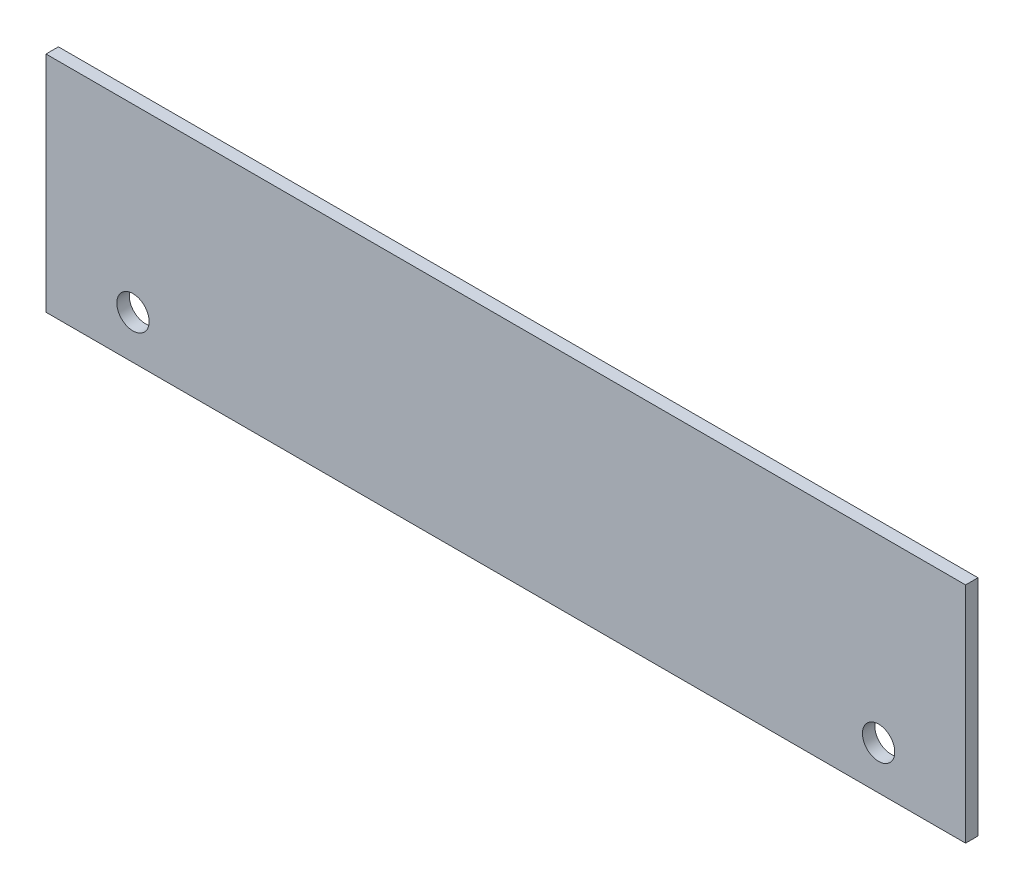
ISO-10303-21;
HEADER;
FILE_DESCRIPTION(('STEP AP214'),'2;1');
FILE_NAME('part.step','',(''),(''),'','','');
FILE_SCHEMA(('AUTOMOTIVE_DESIGN { 1 0 10303 214 1 1 1 1 }'));
ENDSEC;
DATA;
#1=APPLICATION_CONTEXT('core data for automotive mechanical design processes');
#2=APPLICATION_PROTOCOL_DEFINITION('international standard','automotive_design',2000,#1);
#3=PRODUCT_CONTEXT('',#1,'mechanical');
#4=PRODUCT('Part','Part','',(#3));
#5=PRODUCT_RELATED_PRODUCT_CATEGORY('part','',(#4));
#6=PRODUCT_DEFINITION_FORMATION('','',#4);
#7=PRODUCT_DEFINITION_CONTEXT('part definition',#1,'design');
#8=PRODUCT_DEFINITION('design','',#6,#7);
#9=PRODUCT_DEFINITION_SHAPE('','',#8);
#10=(LENGTH_UNIT() NAMED_UNIT(*) SI_UNIT(.MILLI.,.METRE.));
#11=(NAMED_UNIT(*) PLANE_ANGLE_UNIT() SI_UNIT($,.RADIAN.));
#12=(NAMED_UNIT(*) SI_UNIT($,.STERADIAN.) SOLID_ANGLE_UNIT());
#13=UNCERTAINTY_MEASURE_WITH_UNIT(LENGTH_MEASURE(1.E-05),#10,'distance_accuracy_value','');
#14=(GEOMETRIC_REPRESENTATION_CONTEXT(3) GLOBAL_UNCERTAINTY_ASSIGNED_CONTEXT((#13)) GLOBAL_UNIT_ASSIGNED_CONTEXT((#10,
#11,#12)) REPRESENTATION_CONTEXT('',''));
#15=CARTESIAN_POINT('',(0.,0.,0.));
#16=DIRECTION('',(0.,0.,1.));
#17=DIRECTION('',(1.,0.,0.));
#18=AXIS2_PLACEMENT_3D('',#15,#16,#17);
#19=CARTESIAN_POINT('',(0.,0.,5.));
#20=DIRECTION('',(0.,0.,1.));
#21=DIRECTION('',(1.,0.,0.));
#22=AXIS2_PLACEMENT_3D('',#19,#20,#21);
#23=PLANE('',#22);
#24=DIRECTION('',(0.,1.,0.));
#25=VECTOR('',#24,1.);
#26=CARTESIAN_POINT('',(185.,45.,5.));
#27=LINE('',#26,#25);
#28=CARTESIAN_POINT('',(185.,-45.,5.));
#29=VERTEX_POINT('',#28);
#30=CARTESIAN_POINT('',(185.,45.,5.));
#31=VERTEX_POINT('',#30);
#32=EDGE_CURVE('E103',#29,#31,#27,.T.);
#33=ORIENTED_EDGE('',*,*,#32,.T.);
#34=DIRECTION('',(-1.,0.,0.));
#35=VECTOR('',#34,1.);
#36=CARTESIAN_POINT('',(-185.,45.,5.));
#37=LINE('',#36,#35);
#38=CARTESIAN_POINT('',(-185.,45.,5.));
#39=VERTEX_POINT('',#38);
#40=EDGE_CURVE('E98',#31,#39,#37,.T.);
#41=ORIENTED_EDGE('',*,*,#40,.T.);
#42=DIRECTION('',(0.,-1.,0.));
#43=VECTOR('',#42,1.);
#44=CARTESIAN_POINT('',(-185.,45.,5.));
#45=LINE('',#44,#43);
#46=CARTESIAN_POINT('',(-185.,-45.,5.));
#47=VERTEX_POINT('',#46);
#48=EDGE_CURVE('E101',#39,#47,#45,.T.);
#49=ORIENTED_EDGE('',*,*,#48,.T.);
#50=DIRECTION('',(1.,0.,0.));
#51=VECTOR('',#50,1.);
#52=CARTESIAN_POINT('',(-185.,-45.,5.));
#53=LINE('',#52,#51);
#54=EDGE_CURVE('E68',#47,#29,#53,.T.);
#55=ORIENTED_EDGE('',*,*,#54,.T.);
#56=EDGE_LOOP('',(#33,#41,#49,#55));
#57=FACE_BOUND('',#56,.T.);
#58=CARTESIAN_POINT('',(150.,-27.5,5.));
#59=DIRECTION('',(0.,0.,1.));
#60=DIRECTION('',(1.,0.,0.));
#61=AXIS2_PLACEMENT_3D('',#58,#59,#60);
#62=CIRCLE('',#61,6.50000000000002);
#63=CARTESIAN_POINT('',(156.5,-27.5,5.));
#64=VERTEX_POINT('',#63);
#65=EDGE_CURVE('E147',#64,#64,#62,.T.);
#66=ORIENTED_EDGE('',*,*,#65,.F.);
#67=EDGE_LOOP('',(#66));
#68=FACE_BOUND('',#67,.T.);
#69=CARTESIAN_POINT('',(-150.,-27.5,5.));
#70=DIRECTION('',(0.,0.,-1.));
#71=DIRECTION('',(-1.,0.,0.));
#72=AXIS2_PLACEMENT_3D('',#69,#70,#71);
#73=CIRCLE('',#72,6.50000000000002);
#74=CARTESIAN_POINT('',(-156.5,-27.5,5.));
#75=VERTEX_POINT('',#74);
#76=EDGE_CURVE('E138',#75,#75,#73,.T.);
#77=ORIENTED_EDGE('',*,*,#76,.T.);
#78=EDGE_LOOP('',(#77));
#79=FACE_BOUND('',#78,.T.);
#80=ADVANCED_FACE('F48',(#57,#68,#79),#23,.T.);
#81=CARTESIAN_POINT('',(0.,0.,0.));
#82=DIRECTION('',(0.,0.,1.));
#83=DIRECTION('',(1.,0.,0.));
#84=AXIS2_PLACEMENT_3D('',#81,#82,#83);
#85=PLANE('',#84);
#86=CARTESIAN_POINT('',(150.,-27.5,0.));
#87=DIRECTION('',(0.,0.,1.));
#88=DIRECTION('',(1.,0.,0.));
#89=AXIS2_PLACEMENT_3D('',#86,#87,#88);
#90=CIRCLE('',#89,6.50000000000002);
#91=CARTESIAN_POINT('',(156.5,-27.5,0.));
#92=VERTEX_POINT('',#91);
#93=EDGE_CURVE('E135',#92,#92,#90,.T.);
#94=ORIENTED_EDGE('',*,*,#93,.T.);
#95=EDGE_LOOP('',(#94));
#96=FACE_BOUND('',#95,.T.);
#97=DIRECTION('',(0.,1.,0.));
#98=VECTOR('',#97,1.);
#99=CARTESIAN_POINT('',(185.,45.,0.));
#100=LINE('',#99,#98);
#101=CARTESIAN_POINT('',(185.,-45.,0.));
#102=VERTEX_POINT('',#101);
#103=CARTESIAN_POINT('',(185.,45.,0.));
#104=VERTEX_POINT('',#103);
#105=EDGE_CURVE('E122',#102,#104,#100,.T.);
#106=ORIENTED_EDGE('',*,*,#105,.F.);
#107=DIRECTION('',(1.,0.,0.));
#108=VECTOR('',#107,1.);
#109=CARTESIAN_POINT('',(-185.,-45.,0.));
#110=LINE('',#109,#108);
#111=CARTESIAN_POINT('',(-185.,-45.,0.));
#112=VERTEX_POINT('',#111);
#113=EDGE_CURVE('E91',#112,#102,#110,.T.);
#114=ORIENTED_EDGE('',*,*,#113,.F.);
#115=DIRECTION('',(0.,-1.,0.));
#116=VECTOR('',#115,1.);
#117=CARTESIAN_POINT('',(-185.,45.,0.));
#118=LINE('',#117,#116);
#119=CARTESIAN_POINT('',(-185.,45.,0.));
#120=VERTEX_POINT('',#119);
#121=EDGE_CURVE('E85',#120,#112,#118,.T.);
#122=ORIENTED_EDGE('',*,*,#121,.F.);
#123=DIRECTION('',(-1.,0.,0.));
#124=VECTOR('',#123,1.);
#125=CARTESIAN_POINT('',(-185.,45.,0.));
#126=LINE('',#125,#124);
#127=EDGE_CURVE('E108',#104,#120,#126,.T.);
#128=ORIENTED_EDGE('',*,*,#127,.F.);
#129=EDGE_LOOP('',(#106,#114,#122,#128));
#130=FACE_BOUND('',#129,.T.);
#131=CARTESIAN_POINT('',(-150.,-27.5,0.));
#132=DIRECTION('',(0.,0.,1.));
#133=DIRECTION('',(1.,0.,0.));
#134=AXIS2_PLACEMENT_3D('',#131,#132,#133);
#135=CIRCLE('',#134,6.50000000000002);
#136=CARTESIAN_POINT('',(-143.5,-27.5,0.));
#137=VERTEX_POINT('',#136);
#138=EDGE_CURVE('E52',#137,#137,#135,.F.);
#139=ORIENTED_EDGE('',*,*,#138,.F.);
#140=EDGE_LOOP('',(#139));
#141=FACE_BOUND('',#140,.T.);
#142=ADVANCED_FACE('F188',(#96,#130,#141),#85,.F.);
#143=CARTESIAN_POINT('',(185.,45.,5.));
#144=DIRECTION('',(-1.,0.,0.));
#145=DIRECTION('',(0.,0.,1.));
#146=AXIS2_PLACEMENT_3D('',#143,#144,#145);
#147=PLANE('',#146);
#148=ORIENTED_EDGE('',*,*,#105,.T.);
#149=DIRECTION('',(0.,0.,-1.));
#150=VECTOR('',#149,1.);
#151=CARTESIAN_POINT('',(185.,45.,5.));
#152=LINE('',#151,#150);
#153=EDGE_CURVE('E11',#31,#104,#152,.T.);
#154=ORIENTED_EDGE('',*,*,#153,.F.);
#155=ORIENTED_EDGE('',*,*,#32,.F.);
#156=DIRECTION('',(0.,0.,-1.));
#157=VECTOR('',#156,1.);
#158=CARTESIAN_POINT('',(185.,-45.,5.));
#159=LINE('',#158,#157);
#160=EDGE_CURVE('E118',#29,#102,#159,.T.);
#161=ORIENTED_EDGE('',*,*,#160,.T.);
#162=EDGE_LOOP('',(#148,#154,#155,#161));
#163=FACE_BOUND('',#162,.T.);
#164=ADVANCED_FACE('F50',(#163),#147,.F.);
#165=CARTESIAN_POINT('',(-185.,45.,5.));
#166=DIRECTION('',(0.,-1.,0.));
#167=DIRECTION('',(0.,0.,-1.));
#168=AXIS2_PLACEMENT_3D('',#165,#166,#167);
#169=PLANE('',#168);
#170=ORIENTED_EDGE('',*,*,#127,.T.);
#171=DIRECTION('',(0.,0.,-1.));
#172=VECTOR('',#171,1.);
#173=CARTESIAN_POINT('',(-185.,45.,5.));
#174=LINE('',#173,#172);
#175=EDGE_CURVE('E59',#39,#120,#174,.T.);
#176=ORIENTED_EDGE('',*,*,#175,.F.);
#177=ORIENTED_EDGE('',*,*,#40,.F.);
#178=ORIENTED_EDGE('',*,*,#153,.T.);
#179=EDGE_LOOP('',(#170,#176,#177,#178));
#180=FACE_BOUND('',#179,.T.);
#181=ADVANCED_FACE('F107',(#180),#169,.F.);
#182=CARTESIAN_POINT('',(-185.,45.,5.));
#183=DIRECTION('',(1.,0.,0.));
#184=DIRECTION('',(0.,0.,-1.));
#185=AXIS2_PLACEMENT_3D('',#182,#183,#184);
#186=PLANE('',#185);
#187=ORIENTED_EDGE('',*,*,#121,.T.);
#188=DIRECTION('',(0.,0.,-1.));
#189=VECTOR('',#188,1.);
#190=CARTESIAN_POINT('',(-185.,-45.,5.));
#191=LINE('',#190,#189);
#192=EDGE_CURVE('E110',#47,#112,#191,.T.);
#193=ORIENTED_EDGE('',*,*,#192,.F.);
#194=ORIENTED_EDGE('',*,*,#48,.F.);
#195=ORIENTED_EDGE('',*,*,#175,.T.);
#196=EDGE_LOOP('',(#187,#193,#194,#195));
#197=FACE_BOUND('',#196,.T.);
#198=ADVANCED_FACE('F112',(#197),#186,.F.);
#199=CARTESIAN_POINT('',(-185.,-45.,5.));
#200=DIRECTION('',(0.,1.,0.));
#201=DIRECTION('',(0.,0.,1.));
#202=AXIS2_PLACEMENT_3D('',#199,#200,#201);
#203=PLANE('',#202);
#204=ORIENTED_EDGE('',*,*,#113,.T.);
#205=ORIENTED_EDGE('',*,*,#160,.F.);
#206=ORIENTED_EDGE('',*,*,#54,.F.);
#207=ORIENTED_EDGE('',*,*,#192,.T.);
#208=EDGE_LOOP('',(#204,#205,#206,#207));
#209=FACE_BOUND('',#208,.T.);
#210=ADVANCED_FACE('F197',(#209),#203,.F.);
#211=CARTESIAN_POINT('',(150.,-27.5,-5.));
#212=DIRECTION('',(0.,0.,1.));
#213=DIRECTION('',(1.,0.,0.));
#214=AXIS2_PLACEMENT_3D('',#211,#212,#213);
#215=CYLINDRICAL_SURFACE('',#214,6.50000000000002);
#216=ORIENTED_EDGE('',*,*,#65,.T.);
#217=EDGE_LOOP('',(#216));
#218=FACE_BOUND('',#217,.T.);
#219=ORIENTED_EDGE('',*,*,#93,.F.);
#220=EDGE_LOOP('',(#219));
#221=FACE_BOUND('',#220,.T.);
#222=ADVANCED_FACE('F185',(#218,#221),#215,.F.);
#223=CARTESIAN_POINT('',(-150.,-27.5,-5.));
#224=DIRECTION('',(0.,0.,1.));
#225=DIRECTION('',(1.,0.,0.));
#226=AXIS2_PLACEMENT_3D('',#223,#224,#225);
#227=CYLINDRICAL_SURFACE('',#226,6.50000000000002);
#228=ORIENTED_EDGE('',*,*,#76,.F.);
#229=EDGE_LOOP('',(#228));
#230=FACE_BOUND('',#229,.T.);
#231=ORIENTED_EDGE('',*,*,#138,.T.);
#232=EDGE_LOOP('',(#231));
#233=FACE_BOUND('',#232,.T.);
#234=ADVANCED_FACE('F213',(#230,#233),#227,.F.);
#235=CLOSED_SHELL('',(#80,#142,#164,#181,#198,#210,#222,#234));
#236=MANIFOLD_SOLID_BREP('B2',#235);
#237=ADVANCED_BREP_SHAPE_REPRESENTATION('',(#18,#236),#14);
#238=SHAPE_DEFINITION_REPRESENTATION(#9,#237);
ENDSEC;
END-ISO-10303-21;
